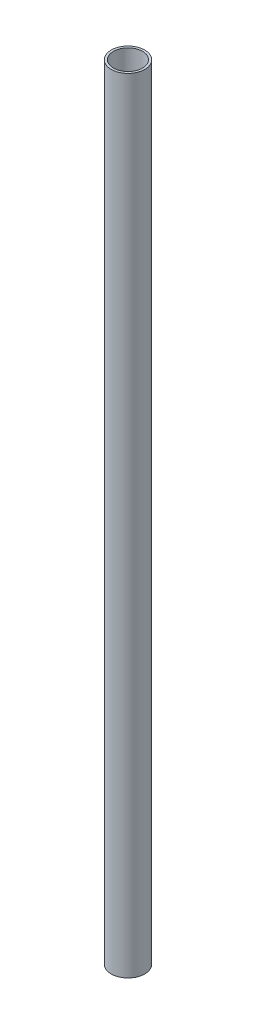
ISO-10303-21;
HEADER;
FILE_DESCRIPTION(('STEP AP214'),'2;1');
FILE_NAME('part.step','',(''),(''),'','','');
FILE_SCHEMA(('AUTOMOTIVE_DESIGN { 1 0 10303 214 1 1 1 1 }'));
ENDSEC;
DATA;
#1=APPLICATION_CONTEXT('core data for automotive mechanical design processes');
#2=APPLICATION_PROTOCOL_DEFINITION('international standard','automotive_design',2000,#1);
#3=PRODUCT_CONTEXT('',#1,'mechanical');
#4=PRODUCT('Part','Part','',(#3));
#5=PRODUCT_RELATED_PRODUCT_CATEGORY('part','',(#4));
#6=PRODUCT_DEFINITION_FORMATION('','',#4);
#7=PRODUCT_DEFINITION_CONTEXT('part definition',#1,'design');
#8=PRODUCT_DEFINITION('design','',#6,#7);
#9=PRODUCT_DEFINITION_SHAPE('','',#8);
#10=(LENGTH_UNIT() NAMED_UNIT(*) SI_UNIT(.MILLI.,.METRE.));
#11=(NAMED_UNIT(*) PLANE_ANGLE_UNIT() SI_UNIT($,.RADIAN.));
#12=(NAMED_UNIT(*) SI_UNIT($,.STERADIAN.) SOLID_ANGLE_UNIT());
#13=UNCERTAINTY_MEASURE_WITH_UNIT(LENGTH_MEASURE(1.E-05),#10,'distance_accuracy_value','');
#14=(GEOMETRIC_REPRESENTATION_CONTEXT(3) GLOBAL_UNCERTAINTY_ASSIGNED_CONTEXT((#13)) GLOBAL_UNIT_ASSIGNED_CONTEXT((#10,
#11,#12)) REPRESENTATION_CONTEXT('',''));
#15=CARTESIAN_POINT('',(0.,0.,0.));
#16=DIRECTION('',(0.,0.,1.));
#17=DIRECTION('',(1.,0.,0.));
#18=AXIS2_PLACEMENT_3D('',#15,#16,#17);
#19=CARTESIAN_POINT('',(0.,700.,0.));
#20=DIRECTION('',(0.,1.,0.));
#21=DIRECTION('',(0.,0.,1.));
#22=AXIS2_PLACEMENT_3D('',#19,#20,#21);
#23=PLANE('',#22);
#24=CARTESIAN_POINT('',(0.,700.,0.));
#25=DIRECTION('',(0.,1.,0.));
#26=DIRECTION('',(0.,0.,1.));
#27=AXIS2_PLACEMENT_3D('',#24,#25,#26);
#28=CIRCLE('',#27,15.);
#29=CARTESIAN_POINT('',(0.,700.,15.));
#30=VERTEX_POINT('',#29);
#31=EDGE_CURVE('E12',#30,#30,#28,.T.);
#32=ORIENTED_EDGE('',*,*,#31,.T.);
#33=EDGE_LOOP('',(#32));
#34=FACE_BOUND('',#33,.T.);
#35=CARTESIAN_POINT('',(0.,700.,0.));
#36=DIRECTION('',(0.,1.,0.));
#37=DIRECTION('',(0.,0.,1.));
#38=AXIS2_PLACEMENT_3D('',#35,#36,#37);
#39=CIRCLE('',#38,13.);
#40=CARTESIAN_POINT('',(0.,700.,13.));
#41=VERTEX_POINT('',#40);
#42=EDGE_CURVE('E52',#41,#41,#39,.T.);
#43=ORIENTED_EDGE('',*,*,#42,.F.);
#44=EDGE_LOOP('',(#43));
#45=FACE_BOUND('',#44,.T.);
#46=ADVANCED_FACE('F41',(#34,#45),#23,.T.);
#47=CARTESIAN_POINT('',(0.,0.,0.));
#48=DIRECTION('',(0.,1.,0.));
#49=DIRECTION('',(0.,0.,1.));
#50=AXIS2_PLACEMENT_3D('',#47,#48,#49);
#51=PLANE('',#50);
#52=CARTESIAN_POINT('',(0.,0.,0.));
#53=DIRECTION('',(0.,1.,0.));
#54=DIRECTION('',(0.,0.,1.));
#55=AXIS2_PLACEMENT_3D('',#52,#53,#54);
#56=CIRCLE('',#55,15.);
#57=CARTESIAN_POINT('',(0.,0.,15.));
#58=VERTEX_POINT('',#57);
#59=EDGE_CURVE('E45',#58,#58,#56,.T.);
#60=ORIENTED_EDGE('',*,*,#59,.F.);
#61=EDGE_LOOP('',(#60));
#62=FACE_BOUND('',#61,.T.);
#63=CARTESIAN_POINT('',(0.,0.,0.));
#64=DIRECTION('',(0.,1.,0.));
#65=DIRECTION('',(0.,0.,1.));
#66=AXIS2_PLACEMENT_3D('',#63,#64,#65);
#67=CIRCLE('',#66,13.);
#68=CARTESIAN_POINT('',(0.,0.,13.));
#69=VERTEX_POINT('',#68);
#70=EDGE_CURVE('E54',#69,#69,#67,.T.);
#71=ORIENTED_EDGE('',*,*,#70,.T.);
#72=EDGE_LOOP('',(#71));
#73=FACE_BOUND('',#72,.T.);
#74=ADVANCED_FACE('F64',(#62,#73),#51,.F.);
#75=CARTESIAN_POINT('',(0.,700.,0.));
#76=DIRECTION('',(0.,-1.,0.));
#77=DIRECTION('',(0.,0.,-1.));
#78=AXIS2_PLACEMENT_3D('',#75,#76,#77);
#79=CYLINDRICAL_SURFACE('',#78,15.);
#80=ORIENTED_EDGE('',*,*,#31,.F.);
#81=EDGE_LOOP('',(#80));
#82=FACE_BOUND('',#81,.T.);
#83=ORIENTED_EDGE('',*,*,#59,.T.);
#84=EDGE_LOOP('',(#83));
#85=FACE_BOUND('',#84,.T.);
#86=ADVANCED_FACE('F43',(#82,#85),#79,.T.);
#87=CARTESIAN_POINT('',(0.,700.,0.));
#88=DIRECTION('',(0.,-1.,0.));
#89=DIRECTION('',(0.,0.,-1.));
#90=AXIS2_PLACEMENT_3D('',#87,#88,#89);
#91=CYLINDRICAL_SURFACE('',#90,13.);
#92=ORIENTED_EDGE('',*,*,#42,.T.);
#93=EDGE_LOOP('',(#92));
#94=FACE_BOUND('',#93,.T.);
#95=ORIENTED_EDGE('',*,*,#70,.F.);
#96=EDGE_LOOP('',(#95));
#97=FACE_BOUND('',#96,.T.);
#98=ADVANCED_FACE('F60',(#94,#97),#91,.F.);
#99=CLOSED_SHELL('',(#46,#74,#86,#98));
#100=MANIFOLD_SOLID_BREP('B2',#99);
#101=ADVANCED_BREP_SHAPE_REPRESENTATION('',(#18,#100),#14);
#102=SHAPE_DEFINITION_REPRESENTATION(#9,#101);
ENDSEC;
END-ISO-10303-21;
